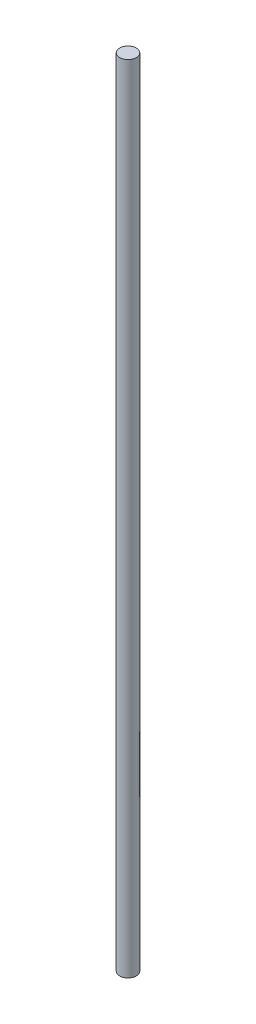
ISO-10303-21;
HEADER;
FILE_DESCRIPTION(('STEP AP214'),'2;1');
FILE_NAME('part.step','',(''),(''),'','','');
FILE_SCHEMA(('AUTOMOTIVE_DESIGN { 1 0 10303 214 1 1 1 1 }'));
ENDSEC;
DATA;
#1=APPLICATION_CONTEXT('core data for automotive mechanical design processes');
#2=APPLICATION_PROTOCOL_DEFINITION('international standard','automotive_design',2000,#1);
#3=PRODUCT_CONTEXT('',#1,'mechanical');
#4=PRODUCT('Part','Part','',(#3));
#5=PRODUCT_RELATED_PRODUCT_CATEGORY('part','',(#4));
#6=PRODUCT_DEFINITION_FORMATION('','',#4);
#7=PRODUCT_DEFINITION_CONTEXT('part definition',#1,'design');
#8=PRODUCT_DEFINITION('design','',#6,#7);
#9=PRODUCT_DEFINITION_SHAPE('','',#8);
#10=(LENGTH_UNIT() NAMED_UNIT(*) SI_UNIT(.MILLI.,.METRE.));
#11=(NAMED_UNIT(*) PLANE_ANGLE_UNIT() SI_UNIT($,.RADIAN.));
#12=(NAMED_UNIT(*) SI_UNIT($,.STERADIAN.) SOLID_ANGLE_UNIT());
#13=UNCERTAINTY_MEASURE_WITH_UNIT(LENGTH_MEASURE(1.E-05),#10,'distance_accuracy_value','');
#14=(GEOMETRIC_REPRESENTATION_CONTEXT(3) GLOBAL_UNCERTAINTY_ASSIGNED_CONTEXT((#13)) GLOBAL_UNIT_ASSIGNED_CONTEXT((#10,
#11,#12)) REPRESENTATION_CONTEXT('',''));
#15=CARTESIAN_POINT('',(0.,0.,0.));
#16=DIRECTION('',(0.,0.,1.));
#17=DIRECTION('',(1.,0.,0.));
#18=AXIS2_PLACEMENT_3D('',#15,#16,#17);
#19=CARTESIAN_POINT('',(0.,382.,0.));
#20=DIRECTION('',(0.,-1.,0.));
#21=DIRECTION('',(0.,0.,-1.));
#22=AXIS2_PLACEMENT_3D('',#19,#20,#21);
#23=CYLINDRICAL_SURFACE('',#22,4.);
#24=CARTESIAN_POINT('',(0.,382.,0.));
#25=DIRECTION('',(0.,1.,0.));
#26=DIRECTION('',(0.,0.,1.));
#27=AXIS2_PLACEMENT_3D('',#24,#25,#26);
#28=CIRCLE('',#27,4.);
#29=CARTESIAN_POINT('',(0.,382.,4.));
#30=VERTEX_POINT('',#29);
#31=EDGE_CURVE('E10',#30,#30,#28,.T.);
#32=ORIENTED_EDGE('',*,*,#31,.F.);
#33=EDGE_LOOP('',(#32));
#34=FACE_BOUND('',#33,.T.);
#35=CARTESIAN_POINT('',(0.,0.,0.));
#36=DIRECTION('',(0.,1.,0.));
#37=DIRECTION('',(0.,0.,1.));
#38=AXIS2_PLACEMENT_3D('',#35,#36,#37);
#39=CIRCLE('',#38,4.);
#40=CARTESIAN_POINT('',(0.,0.,4.));
#41=VERTEX_POINT('',#40);
#42=EDGE_CURVE('E34',#41,#41,#39,.T.);
#43=ORIENTED_EDGE('',*,*,#42,.T.);
#44=EDGE_LOOP('',(#43));
#45=FACE_BOUND('',#44,.T.);
#46=ADVANCED_FACE('F31',(#34,#45),#23,.T.);
#47=CARTESIAN_POINT('',(0.,382.,0.));
#48=DIRECTION('',(0.,1.,0.));
#49=DIRECTION('',(0.,0.,1.));
#50=AXIS2_PLACEMENT_3D('',#47,#48,#49);
#51=PLANE('',#50);
#52=ORIENTED_EDGE('',*,*,#31,.T.);
#53=EDGE_LOOP('',(#52));
#54=FACE_BOUND('',#53,.T.);
#55=ADVANCED_FACE('F46',(#54),#51,.T.);
#56=CARTESIAN_POINT('',(0.,0.,0.));
#57=DIRECTION('',(0.,1.,0.));
#58=DIRECTION('',(0.,0.,1.));
#59=AXIS2_PLACEMENT_3D('',#56,#57,#58);
#60=PLANE('',#59);
#61=ORIENTED_EDGE('',*,*,#42,.F.);
#62=EDGE_LOOP('',(#61));
#63=FACE_BOUND('',#62,.T.);
#64=ADVANCED_FACE('F44',(#63),#60,.F.);
#65=CLOSED_SHELL('',(#46,#55,#64));
#66=MANIFOLD_SOLID_BREP('B2',#65);
#67=ADVANCED_BREP_SHAPE_REPRESENTATION('',(#18,#66),#14);
#68=SHAPE_DEFINITION_REPRESENTATION(#9,#67);
ENDSEC;
END-ISO-10303-21;
